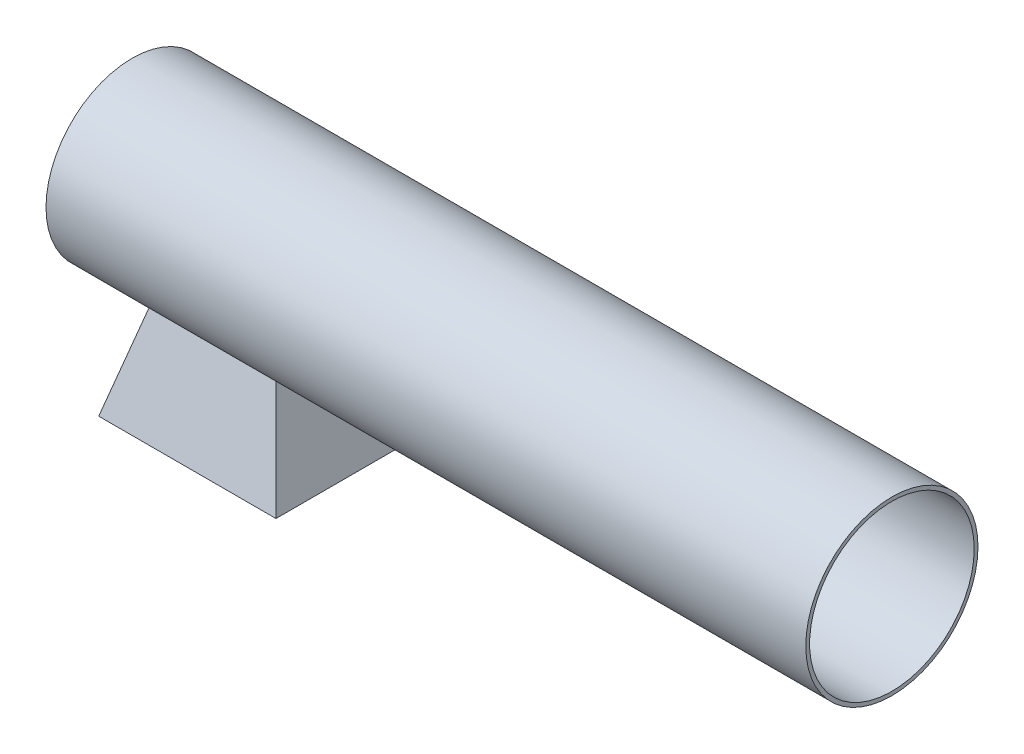
ISO-10303-21;
HEADER;
FILE_DESCRIPTION(('STEP AP214'),'2;1');
FILE_NAME('part.step','',(''),(''),'','','');
FILE_SCHEMA(('AUTOMOTIVE_DESIGN { 1 0 10303 214 1 1 1 1 }'));
ENDSEC;
DATA;
#1=APPLICATION_CONTEXT('core data for automotive mechanical design processes');
#2=APPLICATION_PROTOCOL_DEFINITION('international standard','automotive_design',2000,#1);
#3=PRODUCT_CONTEXT('',#1,'mechanical');
#4=PRODUCT('Part','Part','',(#3));
#5=PRODUCT_RELATED_PRODUCT_CATEGORY('part','',(#4));
#6=PRODUCT_DEFINITION_FORMATION('','',#4);
#7=PRODUCT_DEFINITION_CONTEXT('part definition',#1,'design');
#8=PRODUCT_DEFINITION('design','',#6,#7);
#9=PRODUCT_DEFINITION_SHAPE('','',#8);
#10=(LENGTH_UNIT() NAMED_UNIT(*) SI_UNIT(.MILLI.,.METRE.));
#11=(NAMED_UNIT(*) PLANE_ANGLE_UNIT() SI_UNIT($,.RADIAN.));
#12=(NAMED_UNIT(*) SI_UNIT($,.STERADIAN.) SOLID_ANGLE_UNIT());
#13=UNCERTAINTY_MEASURE_WITH_UNIT(LENGTH_MEASURE(1.E-05),#10,'distance_accuracy_value','');
#14=(GEOMETRIC_REPRESENTATION_CONTEXT(3) GLOBAL_UNCERTAINTY_ASSIGNED_CONTEXT((#13)) GLOBAL_UNIT_ASSIGNED_CONTEXT((#10,
#11,#12)) REPRESENTATION_CONTEXT('',''));
#15=CARTESIAN_POINT('',(0.,0.,0.));
#16=DIRECTION('',(0.,0.,1.));
#17=DIRECTION('',(1.,0.,0.));
#18=AXIS2_PLACEMENT_3D('',#15,#16,#17);
#19=CARTESIAN_POINT('',(300.,0.,0.));
#20=DIRECTION('',(-1.,0.,0.));
#21=DIRECTION('',(0.,0.,1.));
#22=AXIS2_PLACEMENT_3D('',#19,#20,#21);
#23=CYLINDRICAL_SURFACE('',#22,34.);
#24=CARTESIAN_POINT('',(0.,0.,0.));
#25=DIRECTION('',(1.,0.,0.));
#26=DIRECTION('',(0.,0.,-1.));
#27=AXIS2_PLACEMENT_3D('',#24,#25,#26);
#28=CIRCLE('',#27,34.);
#29=CARTESIAN_POINT('',(0.,0.,-34.));
#30=VERTEX_POINT('',#29);
#31=EDGE_CURVE('E38',#30,#30,#28,.T.);
#32=ORIENTED_EDGE('',*,*,#31,.T.);
#33=EDGE_LOOP('',(#32));
#34=FACE_BOUND('',#33,.T.);
#35=CARTESIAN_POINT('',(300.,0.,0.));
#36=DIRECTION('',(1.,0.,0.));
#37=DIRECTION('',(0.,0.,-1.));
#38=AXIS2_PLACEMENT_3D('',#35,#36,#37);
#39=CIRCLE('',#38,34.);
#40=CARTESIAN_POINT('',(300.,0.,-34.));
#41=VERTEX_POINT('',#40);
#42=EDGE_CURVE('E11',#41,#41,#39,.T.);
#43=ORIENTED_EDGE('',*,*,#42,.F.);
#44=EDGE_LOOP('',(#43));
#45=FACE_BOUND('',#44,.T.);
#46=DIRECTION('',(-1.,0.,0.));
#47=VECTOR('',#46,1.);
#48=CARTESIAN_POINT('',(300.,-22.9612576856124,25.0754989081954));
#49=LINE('',#48,#47);
#50=CARTESIAN_POINT('',(31.7320766488807,-22.9612576856124,25.0754989081954));
#51=VERTEX_POINT('',#50);
#52=CARTESIAN_POINT('',(81.8830744652713,-22.9612576856124,25.0754989081954));
#53=VERTEX_POINT('',#52);
#54=EDGE_CURVE('E156',#51,#53,#49,.F.);
#55=ORIENTED_EDGE('',*,*,#54,.T.);
#56=CARTESIAN_POINT('',(75.7306240112086,0.,0.));
#57=DIRECTION('',(0.965925826289068,0.258819045102521,0.));
#58=DIRECTION('',(-0.258819045102521,0.965925826289068,0.));
#59=AXIS2_PLACEMENT_3D('',#56,#57,#58);
#60=ELLIPSE('',#59,35.1993901339428,34.);
#61=CARTESIAN_POINT('',(81.8830744652713,-22.9612576856124,-25.0754989081954));
#62=VERTEX_POINT('',#61);
#63=EDGE_CURVE('E139',#53,#62,#60,.T.);
#64=ORIENTED_EDGE('',*,*,#63,.T.);
#65=DIRECTION('',(-1.,0.,0.));
#66=VECTOR('',#65,1.);
#67=CARTESIAN_POINT('',(300.,-22.9612576856124,-25.0754989081954));
#68=LINE('',#67,#66);
#69=CARTESIAN_POINT('',(31.7320766488806,-22.9612576856124,-25.0754989081954));
#70=VERTEX_POINT('',#69);
#71=EDGE_CURVE('E137',#62,#70,#68,.T.);
#72=ORIENTED_EDGE('',*,*,#71,.T.);
#73=CARTESIAN_POINT('',(37.8845271029434,0.,0.));
#74=DIRECTION('',(-0.965925826289068,0.258819045102521,0.));
#75=DIRECTION('',(-0.258819045102521,-0.965925826289068,0.));
#76=AXIS2_PLACEMENT_3D('',#73,#74,#75);
#77=ELLIPSE('',#76,35.1993901339428,34.);
#78=EDGE_CURVE('E135',#70,#51,#77,.T.);
#79=ORIENTED_EDGE('',*,*,#78,.T.);
#80=EDGE_LOOP('',(#55,#64,#72,#79));
#81=FACE_BOUND('',#80,.T.);
#82=ADVANCED_FACE('F35',(#34,#45,#81),#23,.T.);
#83=CARTESIAN_POINT('',(300.,0.,0.));
#84=DIRECTION('',(1.,0.,0.));
#85=DIRECTION('',(0.,0.,-1.));
#86=AXIS2_PLACEMENT_3D('',#83,#84,#85);
#87=PLANE('',#86);
#88=ORIENTED_EDGE('',*,*,#42,.T.);
#89=EDGE_LOOP('',(#88));
#90=FACE_BOUND('',#89,.T.);
#91=CARTESIAN_POINT('',(300.,0.,0.));
#92=DIRECTION('',(1.,0.,0.));
#93=DIRECTION('',(0.,0.,-1.));
#94=AXIS2_PLACEMENT_3D('',#91,#92,#93);
#95=CIRCLE('',#94,32.5);
#96=CARTESIAN_POINT('',(300.,0.,-32.5));
#97=VERTEX_POINT('',#96);
#98=EDGE_CURVE('E164',#97,#97,#95,.T.);
#99=ORIENTED_EDGE('',*,*,#98,.F.);
#100=EDGE_LOOP('',(#99));
#101=FACE_BOUND('',#100,.T.);
#102=ADVANCED_FACE('F182',(#90,#101),#87,.T.);
#103=CARTESIAN_POINT('',(0.,0.,0.));
#104=DIRECTION('',(1.,0.,0.));
#105=DIRECTION('',(0.,0.,-1.));
#106=AXIS2_PLACEMENT_3D('',#103,#104,#105);
#107=PLANE('',#106);
#108=ORIENTED_EDGE('',*,*,#31,.F.);
#109=EDGE_LOOP('',(#108));
#110=FACE_BOUND('',#109,.T.);
#111=CARTESIAN_POINT('',(0.,0.,0.));
#112=DIRECTION('',(1.,0.,0.));
#113=DIRECTION('',(0.,0.,-1.));
#114=AXIS2_PLACEMENT_3D('',#111,#112,#113);
#115=CIRCLE('',#114,32.5);
#116=CARTESIAN_POINT('',(0.,0.,-32.5));
#117=VERTEX_POINT('',#116);
#118=EDGE_CURVE('E163',#117,#117,#115,.T.);
#119=ORIENTED_EDGE('',*,*,#118,.T.);
#120=EDGE_LOOP('',(#119));
#121=FACE_BOUND('',#120,.T.);
#122=ADVANCED_FACE('F170',(#110,#121),#107,.F.);
#123=CARTESIAN_POINT('',(300.,0.,0.));
#124=DIRECTION('',(-1.,0.,0.));
#125=DIRECTION('',(0.,0.,1.));
#126=AXIS2_PLACEMENT_3D('',#123,#124,#125);
#127=CYLINDRICAL_SURFACE('',#126,32.5);
#128=DIRECTION('',(-1.,0.,0.));
#129=VECTOR('',#128,1.);
#130=CARTESIAN_POINT('',(300.,-20.7665596572952,-25.));
#131=LINE('',#130,#129);
#132=CARTESIAN_POINT('',(81.807575557076,-20.7665596572952,-25.));
#133=VERTEX_POINT('',#132);
#134=CARTESIAN_POINT('',(31.807575557076,-20.7665596572952,-25.));
#135=VERTEX_POINT('',#134);
#136=EDGE_CURVE('E103',#133,#135,#131,.T.);
#137=ORIENTED_EDGE('',*,*,#136,.F.);
#138=CARTESIAN_POINT('',(81.807575557076,0.,0.));
#139=DIRECTION('',(-1.,0.,0.));
#140=DIRECTION('',(0.,0.,1.));
#141=AXIS2_PLACEMENT_3D('',#138,#139,#140);
#142=CIRCLE('',#141,32.5);
#143=CARTESIAN_POINT('',(81.807575557076,-20.7665596572952,25.));
#144=VERTEX_POINT('',#143);
#145=EDGE_CURVE('E131',#133,#144,#142,.T.);
#146=ORIENTED_EDGE('',*,*,#145,.T.);
#147=DIRECTION('',(-1.,0.,0.));
#148=VECTOR('',#147,1.);
#149=CARTESIAN_POINT('',(300.,-20.7665596572952,25.));
#150=LINE('',#149,#148);
#151=CARTESIAN_POINT('',(31.807575557076,-20.7665596572952,25.));
#152=VERTEX_POINT('',#151);
#153=EDGE_CURVE('E128',#144,#152,#150,.T.);
#154=ORIENTED_EDGE('',*,*,#153,.T.);
#155=CARTESIAN_POINT('',(31.807575557076,0.,0.));
#156=DIRECTION('',(-1.,0.,0.));
#157=DIRECTION('',(0.,0.,1.));
#158=AXIS2_PLACEMENT_3D('',#155,#156,#157);
#159=CIRCLE('',#158,32.5);
#160=EDGE_CURVE('E122',#135,#152,#159,.T.);
#161=ORIENTED_EDGE('',*,*,#160,.F.);
#162=EDGE_LOOP('',(#137,#146,#154,#161));
#163=FACE_BOUND('',#162,.T.);
#164=ORIENTED_EDGE('',*,*,#98,.T.);
#165=EDGE_LOOP('',(#164));
#166=FACE_BOUND('',#165,.T.);
#167=ORIENTED_EDGE('',*,*,#118,.F.);
#168=EDGE_LOOP('',(#167));
#169=FACE_BOUND('',#168,.T.);
#170=ADVANCED_FACE('F172',(#163,#166,#169),#127,.F.);
#171=CARTESIAN_POINT('',(0.,-60.,0.));
#172=DIRECTION('',(0.,-1.,0.));
#173=DIRECTION('',(0.,0.,-1.));
#174=AXIS2_PLACEMENT_3D('',#171,#172,#173);
#175=PLANE('',#174);
#176=DIRECTION('',(-1.,0.,0.));
#177=VECTOR('',#176,1.);
#178=CARTESIAN_POINT('',(0.,-60.,-25.));
#179=LINE('',#178,#177);
#180=CARTESIAN_POINT('',(81.807575557076,-60.,-25.));
#181=VERTEX_POINT('',#180);
#182=CARTESIAN_POINT('',(31.807575557076,-60.,-25.));
#183=VERTEX_POINT('',#182);
#184=EDGE_CURVE('E100',#181,#183,#179,.T.);
#185=ORIENTED_EDGE('',*,*,#184,.T.);
#186=DIRECTION('',(0.,0.,1.));
#187=VECTOR('',#186,1.);
#188=CARTESIAN_POINT('',(31.807575557076,-60.,0.));
#189=LINE('',#188,#187);
#190=CARTESIAN_POINT('',(31.807575557076,-60.,25.));
#191=VERTEX_POINT('',#190);
#192=EDGE_CURVE('E108',#183,#191,#189,.T.);
#193=ORIENTED_EDGE('',*,*,#192,.T.);
#194=DIRECTION('',(-1.,0.,0.));
#195=VECTOR('',#194,1.);
#196=CARTESIAN_POINT('',(0.,-60.,25.));
#197=LINE('',#196,#195);
#198=CARTESIAN_POINT('',(81.807575557076,-60.,25.));
#199=VERTEX_POINT('',#198);
#200=EDGE_CURVE('E112',#199,#191,#197,.T.);
#201=ORIENTED_EDGE('',*,*,#200,.F.);
#202=DIRECTION('',(0.,0.,1.));
#203=VECTOR('',#202,1.);
#204=CARTESIAN_POINT('',(81.807575557076,-60.,0.));
#205=LINE('',#204,#203);
#206=EDGE_CURVE('E105',#181,#199,#205,.T.);
#207=ORIENTED_EDGE('',*,*,#206,.F.);
#208=EDGE_LOOP('',(#185,#193,#201,#207));
#209=FACE_BOUND('',#208,.T.);
#210=DIRECTION('',(0.,0.,-1.));
#211=VECTOR('',#210,1.);
#212=CARTESIAN_POINT('',(91.807575557076,-60.,-35.));
#213=LINE('',#212,#211);
#214=CARTESIAN_POINT('',(91.807575557076,-60.,35.));
#215=VERTEX_POINT('',#214);
#216=CARTESIAN_POINT('',(91.807575557076,-60.,-35.));
#217=VERTEX_POINT('',#216);
#218=EDGE_CURVE('E141',#215,#217,#213,.T.);
#219=ORIENTED_EDGE('',*,*,#218,.F.);
#220=DIRECTION('',(1.,0.,0.));
#221=VECTOR('',#220,1.);
#222=CARTESIAN_POINT('',(91.807575557076,-60.,35.));
#223=LINE('',#222,#221);
#224=CARTESIAN_POINT('',(21.807575557076,-60.,35.));
#225=VERTEX_POINT('',#224);
#226=EDGE_CURVE('E150',#225,#215,#223,.T.);
#227=ORIENTED_EDGE('',*,*,#226,.F.);
#228=DIRECTION('',(0.,0.,1.));
#229=VECTOR('',#228,1.);
#230=CARTESIAN_POINT('',(21.807575557076,-60.,-35.));
#231=LINE('',#230,#229);
#232=CARTESIAN_POINT('',(21.807575557076,-60.,-35.));
#233=VERTEX_POINT('',#232);
#234=EDGE_CURVE('E147',#233,#225,#231,.T.);
#235=ORIENTED_EDGE('',*,*,#234,.F.);
#236=DIRECTION('',(-1.,0.,0.));
#237=VECTOR('',#236,1.);
#238=CARTESIAN_POINT('',(91.807575557076,-60.,-35.));
#239=LINE('',#238,#237);
#240=EDGE_CURVE('E144',#217,#233,#239,.T.);
#241=ORIENTED_EDGE('',*,*,#240,.F.);
#242=EDGE_LOOP('',(#219,#227,#235,#241));
#243=FACE_BOUND('',#242,.T.);
#244=ADVANCED_FACE('F114',(#209,#243),#175,.T.);
#245=CARTESIAN_POINT('',(91.807575557076,-60.,35.));
#246=DIRECTION('',(0.,0.258819045102521,0.965925826289068));
#247=DIRECTION('',(0.,-0.965925826289068,0.258819045102521));
#248=AXIS2_PLACEMENT_3D('',#245,#246,#247);
#249=PLANE('',#248);
#250=ORIENTED_EDGE('',*,*,#54,.F.);
#251=DIRECTION('',(-0.250562807085732,-0.935113126531029,0.250562807085732));
#252=VECTOR('',#251,1.);
#253=CARTESIAN_POINT('',(26.2022959777037,-43.5986801051569,30.6052795793723));
#254=LINE('',#253,#252);
#255=EDGE_CURVE('E159',#51,#225,#254,.T.);
#256=ORIENTED_EDGE('',*,*,#255,.T.);
#257=ORIENTED_EDGE('',*,*,#226,.T.);
#258=DIRECTION('',(0.250562807085732,-0.935113126531029,0.250562807085732));
#259=VECTOR('',#258,1.);
#260=CARTESIAN_POINT('',(87.4128551364483,-43.5986801051569,30.6052795793723));
#261=LINE('',#260,#259);
#262=EDGE_CURVE('E153',#53,#215,#261,.T.);
#263=ORIENTED_EDGE('',*,*,#262,.F.);
#264=EDGE_LOOP('',(#250,#256,#257,#263));
#265=FACE_BOUND('',#264,.T.);
#266=ADVANCED_FACE('F180',(#265),#249,.T.);
#267=CARTESIAN_POINT('',(21.807575557076,-60.,-35.));
#268=DIRECTION('',(-0.965925826289068,0.258819045102521,0.));
#269=DIRECTION('',(-0.258819045102521,-0.965925826289068,0.));
#270=AXIS2_PLACEMENT_3D('',#267,#268,#269);
#271=PLANE('',#270);
#272=ORIENTED_EDGE('',*,*,#78,.F.);
#273=DIRECTION('',(-0.250562807085732,-0.935113126531029,-0.250562807085732));
#274=VECTOR('',#273,1.);
#275=CARTESIAN_POINT('',(21.807575557076,-60.,-35.));
#276=LINE('',#275,#274);
#277=EDGE_CURVE('E157',#70,#233,#276,.T.);
#278=ORIENTED_EDGE('',*,*,#277,.T.);
#279=ORIENTED_EDGE('',*,*,#234,.T.);
#280=ORIENTED_EDGE('',*,*,#255,.F.);
#281=EDGE_LOOP('',(#272,#278,#279,#280));
#282=FACE_BOUND('',#281,.T.);
#283=ADVANCED_FACE('F216',(#282),#271,.T.);
#284=CARTESIAN_POINT('',(91.807575557076,-60.,-35.));
#285=DIRECTION('',(0.,0.258819045102521,-0.965925826289068));
#286=DIRECTION('',(0.,0.965925826289068,0.258819045102521));
#287=AXIS2_PLACEMENT_3D('',#284,#285,#286);
#288=PLANE('',#287);
#289=ORIENTED_EDGE('',*,*,#71,.F.);
#290=DIRECTION('',(0.250562807085732,-0.935113126531029,-0.250562807085732));
#291=VECTOR('',#290,1.);
#292=CARTESIAN_POINT('',(91.807575557076,-60.,-35.));
#293=LINE('',#292,#291);
#294=EDGE_CURVE('E154',#62,#217,#293,.T.);
#295=ORIENTED_EDGE('',*,*,#294,.T.);
#296=ORIENTED_EDGE('',*,*,#240,.T.);
#297=ORIENTED_EDGE('',*,*,#277,.F.);
#298=EDGE_LOOP('',(#289,#295,#296,#297));
#299=FACE_BOUND('',#298,.T.);
#300=ADVANCED_FACE('F214',(#299),#288,.T.);
#301=CARTESIAN_POINT('',(91.807575557076,-60.,-35.));
#302=DIRECTION('',(0.965925826289068,0.258819045102521,0.));
#303=DIRECTION('',(-0.258819045102521,0.965925826289068,0.));
#304=AXIS2_PLACEMENT_3D('',#301,#302,#303);
#305=PLANE('',#304);
#306=ORIENTED_EDGE('',*,*,#63,.F.);
#307=ORIENTED_EDGE('',*,*,#262,.T.);
#308=ORIENTED_EDGE('',*,*,#218,.T.);
#309=ORIENTED_EDGE('',*,*,#294,.F.);
#310=EDGE_LOOP('',(#306,#307,#308,#309));
#311=FACE_BOUND('',#310,.T.);
#312=ADVANCED_FACE('F207',(#311),#305,.T.);
#313=CARTESIAN_POINT('',(0.,-60.,-25.));
#314=DIRECTION('',(0.,0.,-1.));
#315=DIRECTION('',(-1.,0.,0.));
#316=AXIS2_PLACEMENT_3D('',#313,#314,#315);
#317=PLANE('',#316);
#318=ORIENTED_EDGE('',*,*,#136,.T.);
#319=DIRECTION('',(0.,1.,0.));
#320=VECTOR('',#319,1.);
#321=CARTESIAN_POINT('',(31.807575557076,-60.,-25.));
#322=LINE('',#321,#320);
#323=EDGE_CURVE('E49',#183,#135,#322,.T.);
#324=ORIENTED_EDGE('',*,*,#323,.F.);
#325=ORIENTED_EDGE('',*,*,#184,.F.);
#326=DIRECTION('',(0.,1.,0.));
#327=VECTOR('',#326,1.);
#328=CARTESIAN_POINT('',(81.807575557076,-60.,-25.));
#329=LINE('',#328,#327);
#330=EDGE_CURVE('E120',#181,#133,#329,.T.);
#331=ORIENTED_EDGE('',*,*,#330,.T.);
#332=EDGE_LOOP('',(#318,#324,#325,#331));
#333=FACE_BOUND('',#332,.T.);
#334=ADVANCED_FACE('F97',(#333),#317,.F.);
#335=CARTESIAN_POINT('',(81.807575557076,-60.,0.));
#336=DIRECTION('',(-1.,0.,0.));
#337=DIRECTION('',(0.,0.,1.));
#338=AXIS2_PLACEMENT_3D('',#335,#336,#337);
#339=PLANE('',#338);
#340=ORIENTED_EDGE('',*,*,#330,.F.);
#341=ORIENTED_EDGE('',*,*,#206,.T.);
#342=DIRECTION('',(0.,1.,0.));
#343=VECTOR('',#342,1.);
#344=CARTESIAN_POINT('',(81.807575557076,-60.,25.));
#345=LINE('',#344,#343);
#346=EDGE_CURVE('E123',#199,#144,#345,.T.);
#347=ORIENTED_EDGE('',*,*,#346,.T.);
#348=ORIENTED_EDGE('',*,*,#145,.F.);
#349=EDGE_LOOP('',(#340,#341,#347,#348));
#350=FACE_BOUND('',#349,.T.);
#351=ADVANCED_FACE('F229',(#350),#339,.T.);
#352=CARTESIAN_POINT('',(0.,-60.,25.));
#353=DIRECTION('',(0.,0.,-1.));
#354=DIRECTION('',(-1.,0.,0.));
#355=AXIS2_PLACEMENT_3D('',#352,#353,#354);
#356=PLANE('',#355);
#357=ORIENTED_EDGE('',*,*,#346,.F.);
#358=ORIENTED_EDGE('',*,*,#200,.T.);
#359=DIRECTION('',(0.,1.,0.));
#360=VECTOR('',#359,1.);
#361=CARTESIAN_POINT('',(31.807575557076,-60.,25.));
#362=LINE('',#361,#360);
#363=EDGE_CURVE('E54',#191,#152,#362,.T.);
#364=ORIENTED_EDGE('',*,*,#363,.T.);
#365=ORIENTED_EDGE('',*,*,#153,.F.);
#366=EDGE_LOOP('',(#357,#358,#364,#365));
#367=FACE_BOUND('',#366,.T.);
#368=ADVANCED_FACE('F232',(#367),#356,.T.);
#369=CARTESIAN_POINT('',(31.807575557076,-60.,0.));
#370=DIRECTION('',(-1.,0.,0.));
#371=DIRECTION('',(0.,0.,1.));
#372=AXIS2_PLACEMENT_3D('',#369,#370,#371);
#373=PLANE('',#372);
#374=ORIENTED_EDGE('',*,*,#160,.T.);
#375=ORIENTED_EDGE('',*,*,#363,.F.);
#376=ORIENTED_EDGE('',*,*,#192,.F.);
#377=ORIENTED_EDGE('',*,*,#323,.T.);
#378=EDGE_LOOP('',(#374,#375,#376,#377));
#379=FACE_BOUND('',#378,.T.);
#380=ADVANCED_FACE('F109',(#379),#373,.F.);
#381=CLOSED_SHELL('',(#82,#102,#122,#170,#244,#266,#283,#300,#312,#334,#351,#368,#380));
#382=MANIFOLD_SOLID_BREP('B2',#381);
#383=ADVANCED_BREP_SHAPE_REPRESENTATION('',(#18,#382),#14);
#384=SHAPE_DEFINITION_REPRESENTATION(#9,#383);
ENDSEC;
END-ISO-10303-21;
